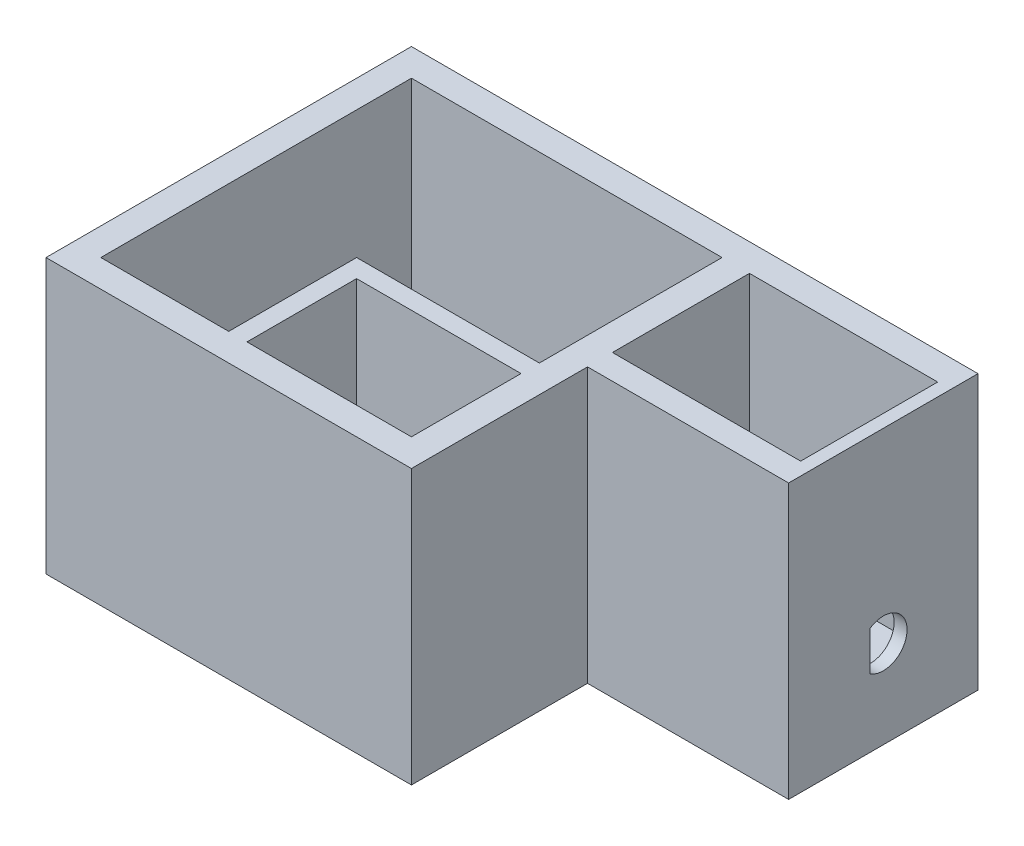
ISO-10303-21;
HEADER;
FILE_DESCRIPTION(('STEP AP214'),'2;1');
FILE_NAME('part.step','',(''),(''),'','','');
FILE_SCHEMA(('AUTOMOTIVE_DESIGN { 1 0 10303 214 1 1 1 1 }'));
ENDSEC;
DATA;
#1=APPLICATION_CONTEXT('core data for automotive mechanical design processes');
#2=APPLICATION_PROTOCOL_DEFINITION('international standard','automotive_design',2000,#1);
#3=PRODUCT_CONTEXT('',#1,'mechanical');
#4=PRODUCT('Part','Part','',(#3));
#5=PRODUCT_RELATED_PRODUCT_CATEGORY('part','',(#4));
#6=PRODUCT_DEFINITION_FORMATION('','',#4);
#7=PRODUCT_DEFINITION_CONTEXT('part definition',#1,'design');
#8=PRODUCT_DEFINITION('design','',#6,#7);
#9=PRODUCT_DEFINITION_SHAPE('','',#8);
#10=(LENGTH_UNIT() NAMED_UNIT(*) SI_UNIT(.MILLI.,.METRE.));
#11=(NAMED_UNIT(*) PLANE_ANGLE_UNIT() SI_UNIT($,.RADIAN.));
#12=(NAMED_UNIT(*) SI_UNIT($,.STERADIAN.) SOLID_ANGLE_UNIT());
#13=UNCERTAINTY_MEASURE_WITH_UNIT(LENGTH_MEASURE(1.E-05),#10,'distance_accuracy_value','');
#14=(GEOMETRIC_REPRESENTATION_CONTEXT(3) GLOBAL_UNCERTAINTY_ASSIGNED_CONTEXT((#13)) GLOBAL_UNIT_ASSIGNED_CONTEXT((#10,
#11,#12)) REPRESENTATION_CONTEXT('',''));
#15=CARTESIAN_POINT('',(0.,0.,0.));
#16=DIRECTION('',(0.,0.,1.));
#17=DIRECTION('',(1.,0.,0.));
#18=AXIS2_PLACEMENT_3D('',#15,#16,#17);
#19=CARTESIAN_POINT('',(0.,75.,0.));
#20=DIRECTION('',(0.,1.,0.));
#21=DIRECTION('',(0.,0.,1.));
#22=AXIS2_PLACEMENT_3D('',#19,#20,#21);
#23=PLANE('',#22);
#24=DIRECTION('',(0.,0.,-1.));
#25=VECTOR('',#24,1.);
#26=CARTESIAN_POINT('',(42.5,75.,-42.5));
#27=LINE('',#26,#25);
#28=CARTESIAN_POINT('',(42.5,75.,7.50000000000001));
#29=VERTEX_POINT('',#28);
#30=CARTESIAN_POINT('',(42.5,75.,-42.5));
#31=VERTEX_POINT('',#30);
#32=EDGE_CURVE('E279',#29,#31,#27,.T.);
#33=ORIENTED_EDGE('',*,*,#32,.F.);
#34=DIRECTION('',(-1.,0.,0.));
#35=VECTOR('',#34,1.);
#36=CARTESIAN_POINT('',(42.5,75.,7.50000000000001));
#37=LINE('',#36,#35);
#38=CARTESIAN_POINT('',(-7.49999999999999,75.,7.50000000000001));
#39=VERTEX_POINT('',#38);
#40=EDGE_CURVE('E481',#29,#39,#37,.T.);
#41=ORIENTED_EDGE('',*,*,#40,.T.);
#42=DIRECTION('',(0.,0.,1.));
#43=VECTOR('',#42,1.);
#44=CARTESIAN_POINT('',(-7.49999999999999,75.,42.5));
#45=LINE('',#44,#43);
#46=CARTESIAN_POINT('',(-7.49999999999999,75.,42.5));
#47=VERTEX_POINT('',#46);
#48=EDGE_CURVE('E483',#39,#47,#45,.T.);
#49=ORIENTED_EDGE('',*,*,#48,.T.);
#50=DIRECTION('',(1.,0.,0.));
#51=VECTOR('',#50,1.);
#52=CARTESIAN_POINT('',(-42.5,75.,42.5));
#53=LINE('',#52,#51);
#54=CARTESIAN_POINT('',(-42.5,75.,42.5));
#55=VERTEX_POINT('',#54);
#56=EDGE_CURVE('E288',#55,#47,#53,.T.);
#57=ORIENTED_EDGE('',*,*,#56,.F.);
#58=DIRECTION('',(0.,0.,1.));
#59=VECTOR('',#58,1.);
#60=CARTESIAN_POINT('',(-42.5,75.,-42.5));
#61=LINE('',#60,#59);
#62=CARTESIAN_POINT('',(-42.5,75.,-42.5));
#63=VERTEX_POINT('',#62);
#64=EDGE_CURVE('E285',#63,#55,#61,.T.);
#65=ORIENTED_EDGE('',*,*,#64,.F.);
#66=DIRECTION('',(-1.,0.,0.));
#67=VECTOR('',#66,1.);
#68=CARTESIAN_POINT('',(-42.5,75.,-42.5));
#69=LINE('',#68,#67);
#70=EDGE_CURVE('E281',#31,#63,#69,.T.);
#71=ORIENTED_EDGE('',*,*,#70,.F.);
#72=EDGE_LOOP('',(#33,#41,#49,#57,#65,#71));
#73=FACE_BOUND('',#72,.T.);
#74=DIRECTION('',(0.,0.,-1.));
#75=VECTOR('',#74,1.);
#76=CARTESIAN_POINT('',(50.,75.,-50.));
#77=LINE('',#76,#75);
#78=CARTESIAN_POINT('',(50.,75.,50.));
#79=VERTEX_POINT('',#78);
#80=CARTESIAN_POINT('',(50.,75.,1.82188212647816));
#81=VERTEX_POINT('',#80);
#82=EDGE_CURVE('E297',#79,#81,#77,.T.);
#83=ORIENTED_EDGE('',*,*,#82,.T.);
#84=DIRECTION('',(-1.,0.,0.));
#85=VECTOR('',#84,1.);
#86=CARTESIAN_POINT('',(50.,75.,1.82188212647816));
#87=LINE('',#86,#85);
#88=CARTESIAN_POINT('',(105.029985219062,75.,1.82188212647816));
#89=VERTEX_POINT('',#88);
#90=EDGE_CURVE('E396',#89,#81,#87,.T.);
#91=ORIENTED_EDGE('',*,*,#90,.F.);
#92=DIRECTION('',(0.,0.,1.));
#93=VECTOR('',#92,1.);
#94=CARTESIAN_POINT('',(105.029985219062,75.,-50.));
#95=LINE('',#94,#93);
#96=CARTESIAN_POINT('',(105.029985219062,75.,-50.));
#97=VERTEX_POINT('',#96);
#98=EDGE_CURVE('E393',#97,#89,#95,.T.);
#99=ORIENTED_EDGE('',*,*,#98,.F.);
#100=DIRECTION('',(-1.,0.,0.));
#101=VECTOR('',#100,1.);
#102=CARTESIAN_POINT('',(-50.,75.,-50.));
#103=LINE('',#102,#101);
#104=CARTESIAN_POINT('',(-50.,75.,-50.));
#105=VERTEX_POINT('',#104);
#106=EDGE_CURVE('E300',#97,#105,#103,.T.);
#107=ORIENTED_EDGE('',*,*,#106,.T.);
#108=DIRECTION('',(0.,0.,1.));
#109=VECTOR('',#108,1.);
#110=CARTESIAN_POINT('',(-50.,75.,-50.));
#111=LINE('',#110,#109);
#112=CARTESIAN_POINT('',(-50.,75.,50.));
#113=VERTEX_POINT('',#112);
#114=EDGE_CURVE('E303',#105,#113,#111,.T.);
#115=ORIENTED_EDGE('',*,*,#114,.T.);
#116=DIRECTION('',(1.,0.,0.));
#117=VECTOR('',#116,1.);
#118=CARTESIAN_POINT('',(-50.,75.,50.));
#119=LINE('',#118,#117);
#120=EDGE_CURVE('E305',#113,#79,#119,.T.);
#121=ORIENTED_EDGE('',*,*,#120,.T.);
#122=EDGE_LOOP('',(#83,#91,#99,#107,#115,#121));
#123=FACE_BOUND('',#122,.T.);
#124=DIRECTION('',(0.,0.,1.));
#125=VECTOR('',#124,1.);
#126=CARTESIAN_POINT('',(42.4897777080494,75.,0.));
#127=LINE('',#126,#125);
#128=CARTESIAN_POINT('',(42.4897777080494,75.,12.5));
#129=VERTEX_POINT('',#128);
#130=CARTESIAN_POINT('',(42.4897777080494,75.,42.5));
#131=VERTEX_POINT('',#130);
#132=EDGE_CURVE('E327',#129,#131,#127,.T.);
#133=ORIENTED_EDGE('',*,*,#132,.T.);
#134=DIRECTION('',(-1.,0.,0.));
#135=VECTOR('',#134,1.);
#136=CARTESIAN_POINT('',(0.,75.,42.5));
#137=LINE('',#136,#135);
#138=CARTESIAN_POINT('',(-2.51022229195064,75.,42.5));
#139=VERTEX_POINT('',#138);
#140=EDGE_CURVE('E330',#131,#139,#137,.T.);
#141=ORIENTED_EDGE('',*,*,#140,.T.);
#142=DIRECTION('',(0.,0.,1.));
#143=VECTOR('',#142,1.);
#144=CARTESIAN_POINT('',(-2.51022229195064,75.,0.));
#145=LINE('',#144,#143);
#146=CARTESIAN_POINT('',(-2.51022229195064,75.,12.5));
#147=VERTEX_POINT('',#146);
#148=EDGE_CURVE('E322',#147,#139,#145,.T.);
#149=ORIENTED_EDGE('',*,*,#148,.F.);
#150=DIRECTION('',(-1.,0.,0.));
#151=VECTOR('',#150,1.);
#152=CARTESIAN_POINT('',(0.,75.,12.5));
#153=LINE('',#152,#151);
#154=EDGE_CURVE('E324',#129,#147,#153,.T.);
#155=ORIENTED_EDGE('',*,*,#154,.F.);
#156=EDGE_LOOP('',(#133,#141,#149,#155));
#157=FACE_BOUND('',#156,.T.);
#158=DIRECTION('',(1.,0.,0.));
#159=VECTOR('',#158,1.);
#160=CARTESIAN_POINT('',(0.,75.,-42.5));
#161=LINE('',#160,#159);
#162=CARTESIAN_POINT('',(50.,75.,-42.5));
#163=VERTEX_POINT('',#162);
#164=CARTESIAN_POINT('',(101.5,75.,-42.5));
#165=VERTEX_POINT('',#164);
#166=EDGE_CURVE('E374',#163,#165,#161,.T.);
#167=ORIENTED_EDGE('',*,*,#166,.T.);
#168=DIRECTION('',(0.,0.,1.));
#169=VECTOR('',#168,1.);
#170=CARTESIAN_POINT('',(101.5,75.,0.));
#171=LINE('',#170,#169);
#172=CARTESIAN_POINT('',(101.5,75.,-5.));
#173=VERTEX_POINT('',#172);
#174=EDGE_CURVE('E337',#165,#173,#171,.T.);
#175=ORIENTED_EDGE('',*,*,#174,.T.);
#176=DIRECTION('',(1.,0.,0.));
#177=VECTOR('',#176,1.);
#178=CARTESIAN_POINT('',(0.,75.,-5.));
#179=LINE('',#178,#177);
#180=CARTESIAN_POINT('',(50.,75.,-5.));
#181=VERTEX_POINT('',#180);
#182=EDGE_CURVE('E363',#181,#173,#179,.T.);
#183=ORIENTED_EDGE('',*,*,#182,.F.);
#184=DIRECTION('',(0.,0.,1.));
#185=VECTOR('',#184,1.);
#186=CARTESIAN_POINT('',(50.,75.,0.));
#187=LINE('',#186,#185);
#188=EDGE_CURVE('E377',#163,#181,#187,.T.);
#189=ORIENTED_EDGE('',*,*,#188,.F.);
#190=EDGE_LOOP('',(#167,#175,#183,#189));
#191=FACE_BOUND('',#190,.T.);
#192=ADVANCED_FACE('F39',(#73,#123,#157,#191),#23,.T.);
#193=CARTESIAN_POINT('',(50.,75.,-50.));
#194=DIRECTION('',(-1.,0.,0.));
#195=DIRECTION('',(0.,0.,1.));
#196=AXIS2_PLACEMENT_3D('',#193,#194,#195);
#197=PLANE('',#196);
#198=DIRECTION('',(0.,-1.,0.));
#199=VECTOR('',#198,1.);
#200=CARTESIAN_POINT('',(50.,75.,1.82188212647816));
#201=LINE('',#200,#199);
#202=CARTESIAN_POINT('',(50.,0.,1.82188212647816));
#203=VERTEX_POINT('',#202);
#204=EDGE_CURVE('E406',#81,#203,#201,.T.);
#205=ORIENTED_EDGE('',*,*,#204,.F.);
#206=ORIENTED_EDGE('',*,*,#82,.F.);
#207=DIRECTION('',(0.,-1.,0.));
#208=VECTOR('',#207,1.);
#209=CARTESIAN_POINT('',(50.,75.,50.));
#210=LINE('',#209,#208);
#211=CARTESIAN_POINT('',(50.,0.,50.));
#212=VERTEX_POINT('',#211);
#213=EDGE_CURVE('E307',#79,#212,#210,.T.);
#214=ORIENTED_EDGE('',*,*,#213,.T.);
#215=DIRECTION('',(0.,0.,-1.));
#216=VECTOR('',#215,1.);
#217=CARTESIAN_POINT('',(50.,0.,-50.));
#218=LINE('',#217,#216);
#219=EDGE_CURVE('E293',#212,#203,#218,.T.);
#220=ORIENTED_EDGE('',*,*,#219,.T.);
#221=EDGE_LOOP('',(#205,#206,#214,#220));
#222=FACE_BOUND('',#221,.T.);
#223=ADVANCED_FACE('F41',(#222),#197,.F.);
#224=CARTESIAN_POINT('',(42.5,9.99999999999999,-42.5));
#225=DIRECTION('',(1.,0.,0.));
#226=DIRECTION('',(0.,0.,-1.));
#227=AXIS2_PLACEMENT_3D('',#224,#225,#226);
#228=PLANE('',#227);
#229=DIRECTION('',(0.,1.,0.));
#230=VECTOR('',#229,1.);
#231=CARTESIAN_POINT('',(42.5,9.99999999999999,0.));
#232=LINE('',#231,#230);
#233=CARTESIAN_POINT('',(42.5,10.,0.));
#234=VERTEX_POINT('',#233);
#235=CARTESIAN_POINT('',(42.5,17.7885607982944,0.));
#236=VERTEX_POINT('',#235);
#237=EDGE_CURVE('E441',#234,#236,#232,.T.);
#238=ORIENTED_EDGE('',*,*,#237,.F.);
#239=DIRECTION('',(0.,0.,-1.));
#240=VECTOR('',#239,1.);
#241=CARTESIAN_POINT('',(42.5,9.99999999999999,-42.5));
#242=LINE('',#241,#240);
#243=CARTESIAN_POINT('',(42.5,9.99999999999999,7.50000000000001));
#244=VERTEX_POINT('',#243);
#245=EDGE_CURVE('E269',#244,#234,#242,.T.);
#246=ORIENTED_EDGE('',*,*,#245,.F.);
#247=DIRECTION('',(0.,-1.,0.));
#248=VECTOR('',#247,1.);
#249=CARTESIAN_POINT('',(42.5,75.,7.50000000000001));
#250=LINE('',#249,#248);
#251=EDGE_CURVE('E282',#29,#244,#250,.T.);
#252=ORIENTED_EDGE('',*,*,#251,.F.);
#253=ORIENTED_EDGE('',*,*,#32,.T.);
#254=DIRECTION('',(0.,1.,0.));
#255=VECTOR('',#254,1.);
#256=CARTESIAN_POINT('',(42.5,9.99999999999999,-42.5));
#257=LINE('',#256,#255);
#258=CARTESIAN_POINT('',(42.5,9.99999999999999,-42.5));
#259=VERTEX_POINT('',#258);
#260=EDGE_CURVE('E278',#259,#31,#257,.T.);
#261=ORIENTED_EDGE('',*,*,#260,.F.);
#262=CARTESIAN_POINT('',(42.5,10.,-28.617843408747));
#263=VERTEX_POINT('',#262);
#264=EDGE_CURVE('E266',#263,#259,#242,.T.);
#265=ORIENTED_EDGE('',*,*,#264,.F.);
#266=DIRECTION('',(0.,1.,0.));
#267=VECTOR('',#266,1.);
#268=CARTESIAN_POINT('',(42.5,9.99999999999999,-28.617843408747));
#269=LINE('',#268,#267);
#270=CARTESIAN_POINT('',(42.5,17.7885607982944,-28.617843408747));
#271=VERTEX_POINT('',#270);
#272=EDGE_CURVE('E428',#263,#271,#269,.T.);
#273=ORIENTED_EDGE('',*,*,#272,.T.);
#274=DIRECTION('',(0.,0.,-1.));
#275=VECTOR('',#274,1.);
#276=CARTESIAN_POINT('',(42.5,17.7885607982944,-42.5));
#277=LINE('',#276,#275);
#278=EDGE_CURVE('E438',#236,#271,#277,.T.);
#279=ORIENTED_EDGE('',*,*,#278,.F.);
#280=EDGE_LOOP('',(#238,#246,#252,#253,#261,#265,#273,#279));
#281=FACE_BOUND('',#280,.T.);
#282=ADVANCED_FACE('F505',(#281),#228,.F.);
#283=CARTESIAN_POINT('',(-42.5,9.99999999999999,42.5));
#284=DIRECTION('',(0.,0.,1.));
#285=DIRECTION('',(1.,0.,0.));
#286=AXIS2_PLACEMENT_3D('',#283,#284,#285);
#287=PLANE('',#286);
#288=DIRECTION('',(0.,-1.,0.));
#289=VECTOR('',#288,1.);
#290=CARTESIAN_POINT('',(-7.49999999999999,75.,42.5));
#291=LINE('',#290,#289);
#292=CARTESIAN_POINT('',(-7.49999999999999,20.8469699351781,42.5));
#293=VERTEX_POINT('',#292);
#294=EDGE_CURVE('E486',#47,#293,#291,.T.);
#295=ORIENTED_EDGE('',*,*,#294,.T.);
#296=DIRECTION('',(1.,0.,0.));
#297=VECTOR('',#296,1.);
#298=CARTESIAN_POINT('',(-18.5102222919506,20.8469699351781,42.5));
#299=LINE('',#298,#297);
#300=CARTESIAN_POINT('',(-2.51022229195064,20.8469699351781,42.5));
#301=VERTEX_POINT('',#300);
#302=EDGE_CURVE('E453',#293,#301,#299,.T.);
#303=ORIENTED_EDGE('',*,*,#302,.T.);
#304=DIRECTION('',(0.,-1.,0.));
#305=VECTOR('',#304,1.);
#306=CARTESIAN_POINT('',(-2.51022229195064,75.000012,42.5));
#307=LINE('',#306,#305);
#308=EDGE_CURVE('E469',#139,#301,#307,.T.);
#309=ORIENTED_EDGE('',*,*,#308,.F.);
#310=ORIENTED_EDGE('',*,*,#140,.F.);
#311=DIRECTION('',(0.,-1.,0.));
#312=VECTOR('',#311,1.);
#313=CARTESIAN_POINT('',(42.4897777080494,75.000012,42.5));
#314=LINE('',#313,#312);
#315=CARTESIAN_POINT('',(42.4897777080494,9.99999999999999,42.5));
#316=VERTEX_POINT('',#315);
#317=EDGE_CURVE('E477',#131,#316,#314,.T.);
#318=ORIENTED_EDGE('',*,*,#317,.T.);
#319=DIRECTION('',(1.,0.,0.));
#320=VECTOR('',#319,1.);
#321=CARTESIAN_POINT('',(-42.5,9.99999999999999,42.5));
#322=LINE('',#321,#320);
#323=CARTESIAN_POINT('',(-42.5,9.99999999999999,42.5));
#324=VERTEX_POINT('',#323);
#325=EDGE_CURVE('E272',#324,#316,#322,.T.);
#326=ORIENTED_EDGE('',*,*,#325,.F.);
#327=DIRECTION('',(0.,1.,0.));
#328=VECTOR('',#327,1.);
#329=CARTESIAN_POINT('',(-42.5,9.99999999999999,42.5));
#330=LINE('',#329,#328);
#331=EDGE_CURVE('E291',#324,#55,#330,.T.);
#332=ORIENTED_EDGE('',*,*,#331,.T.);
#333=ORIENTED_EDGE('',*,*,#56,.T.);
#334=EDGE_LOOP('',(#295,#303,#309,#310,#318,#326,#332,#333));
#335=FACE_BOUND('',#334,.T.);
#336=ADVANCED_FACE('F562',(#335),#287,.F.);
#337=CARTESIAN_POINT('',(0.,9.99999999999999,0.));
#338=DIRECTION('',(0.,1.,0.));
#339=DIRECTION('',(0.,0.,1.));
#340=AXIS2_PLACEMENT_3D('',#337,#338,#339);
#341=PLANE('',#340);
#342=ORIENTED_EDGE('',*,*,#245,.T.);
#343=DIRECTION('',(1.,0.,0.));
#344=VECTOR('',#343,1.);
#345=CARTESIAN_POINT('',(39.,10.,0.));
#346=LINE('',#345,#344);
#347=CARTESIAN_POINT('',(50.,10.,0.));
#348=VERTEX_POINT('',#347);
#349=EDGE_CURVE('E426',#234,#348,#346,.T.);
#350=ORIENTED_EDGE('',*,*,#349,.T.);
#351=DIRECTION('',(0.,0.,-1.));
#352=VECTOR('',#351,1.);
#353=CARTESIAN_POINT('',(50.,10.,0.));
#354=LINE('',#353,#352);
#355=CARTESIAN_POINT('',(50.,10.,-5.));
#356=VERTEX_POINT('',#355);
#357=EDGE_CURVE('E409',#348,#356,#354,.T.);
#358=ORIENTED_EDGE('',*,*,#357,.T.);
#359=DIRECTION('',(1.,0.,0.));
#360=VECTOR('',#359,1.);
#361=CARTESIAN_POINT('',(0.,9.99999999999999,-5.));
#362=LINE('',#361,#360);
#363=CARTESIAN_POINT('',(101.5,9.99999999999999,-5.));
#364=VERTEX_POINT('',#363);
#365=EDGE_CURVE('E368',#356,#364,#362,.T.);
#366=ORIENTED_EDGE('',*,*,#365,.T.);
#367=DIRECTION('',(0.,0.,1.));
#368=VECTOR('',#367,1.);
#369=CARTESIAN_POINT('',(101.5,9.99999999999999,0.));
#370=LINE('',#369,#368);
#371=CARTESIAN_POINT('',(101.5,9.99999999999999,-42.5));
#372=VERTEX_POINT('',#371);
#373=EDGE_CURVE('E360',#372,#364,#370,.T.);
#374=ORIENTED_EDGE('',*,*,#373,.F.);
#375=DIRECTION('',(1.,0.,0.));
#376=VECTOR('',#375,1.);
#377=CARTESIAN_POINT('',(0.,9.99999999999999,-42.5));
#378=LINE('',#377,#376);
#379=CARTESIAN_POINT('',(50.,9.99999999999999,-42.5));
#380=VERTEX_POINT('',#379);
#381=EDGE_CURVE('E362',#380,#372,#378,.T.);
#382=ORIENTED_EDGE('',*,*,#381,.F.);
#383=DIRECTION('',(0.,0.,1.));
#384=VECTOR('',#383,1.);
#385=CARTESIAN_POINT('',(50.,9.99999999999999,0.));
#386=LINE('',#385,#384);
#387=CARTESIAN_POINT('',(50.,9.99999999999999,-28.617843408747));
#388=VERTEX_POINT('',#387);
#389=EDGE_CURVE('E365',#380,#388,#386,.T.);
#390=ORIENTED_EDGE('',*,*,#389,.T.);
#391=DIRECTION('',(1.,0.,0.));
#392=VECTOR('',#391,1.);
#393=CARTESIAN_POINT('',(39.,10.,-28.617843408747));
#394=LINE('',#393,#392);
#395=EDGE_CURVE('E425',#263,#388,#394,.T.);
#396=ORIENTED_EDGE('',*,*,#395,.F.);
#397=ORIENTED_EDGE('',*,*,#264,.T.);
#398=DIRECTION('',(-1.,0.,0.));
#399=VECTOR('',#398,1.);
#400=CARTESIAN_POINT('',(-42.5,9.99999999999999,-42.5));
#401=LINE('',#400,#399);
#402=CARTESIAN_POINT('',(-27.5,9.99999999999999,-42.5));
#403=VERTEX_POINT('',#402);
#404=EDGE_CURVE('E259',#259,#403,#401,.T.);
#405=ORIENTED_EDGE('',*,*,#404,.T.);
#406=DIRECTION('',(0.,0.,1.));
#407=VECTOR('',#406,1.);
#408=CARTESIAN_POINT('',(-27.5,9.99999999999999,-52.5));
#409=LINE('',#408,#407);
#410=CARTESIAN_POINT('',(-27.5,9.99999999999999,-50.));
#411=VERTEX_POINT('',#410);
#412=EDGE_CURVE('E54',#411,#403,#409,.T.);
#413=ORIENTED_EDGE('',*,*,#412,.F.);
#414=DIRECTION('',(1.,0.,0.));
#415=VECTOR('',#414,1.);
#416=CARTESIAN_POINT('',(-50.,9.99999999999999,-50.));
#417=LINE('',#416,#415);
#418=CARTESIAN_POINT('',(-42.5,9.99999999999999,-50.));
#419=VERTEX_POINT('',#418);
#420=EDGE_CURVE('E549',#419,#411,#417,.T.);
#421=ORIENTED_EDGE('',*,*,#420,.F.);
#422=DIRECTION('',(0.,0.,1.));
#423=VECTOR('',#422,1.);
#424=CARTESIAN_POINT('',(-42.5,9.99999999999999,-42.5));
#425=LINE('',#424,#423);
#426=EDGE_CURVE('E268',#419,#324,#425,.T.);
#427=ORIENTED_EDGE('',*,*,#426,.T.);
#428=ORIENTED_EDGE('',*,*,#325,.T.);
#429=DIRECTION('',(0.,0.,-1.));
#430=VECTOR('',#429,1.);
#431=CARTESIAN_POINT('',(42.4897777080494,9.99999999999999,0.));
#432=LINE('',#431,#430);
#433=CARTESIAN_POINT('',(42.4897777080494,9.99999999999999,12.5));
#434=VERTEX_POINT('',#433);
#435=EDGE_CURVE('E461',#316,#434,#432,.T.);
#436=ORIENTED_EDGE('',*,*,#435,.T.);
#437=DIRECTION('',(1.,0.,0.));
#438=VECTOR('',#437,1.);
#439=CARTESIAN_POINT('',(0.,9.99999999999999,12.5));
#440=LINE('',#439,#438);
#441=CARTESIAN_POINT('',(-2.51022229195064,9.99999999999999,12.5));
#442=VERTEX_POINT('',#441);
#443=EDGE_CURVE('E464',#442,#434,#440,.T.);
#444=ORIENTED_EDGE('',*,*,#443,.F.);
#445=DIRECTION('',(0.,0.,-1.));
#446=VECTOR('',#445,1.);
#447=CARTESIAN_POINT('',(-2.51022229195064,9.99999999999999,0.));
#448=LINE('',#447,#446);
#449=CARTESIAN_POINT('',(-2.51022229195064,9.99999999999999,27.5));
#450=VERTEX_POINT('',#449);
#451=EDGE_CURVE('E467',#450,#442,#448,.T.);
#452=ORIENTED_EDGE('',*,*,#451,.F.);
#453=DIRECTION('',(1.,0.,0.));
#454=VECTOR('',#453,1.);
#455=CARTESIAN_POINT('',(-18.5102222919506,9.99999999999999,27.5));
#456=LINE('',#455,#454);
#457=CARTESIAN_POINT('',(-7.49999999999999,9.99999999999999,27.5));
#458=VERTEX_POINT('',#457);
#459=EDGE_CURVE('E450',#458,#450,#456,.T.);
#460=ORIENTED_EDGE('',*,*,#459,.F.);
#461=DIRECTION('',(0.,0.,1.));
#462=VECTOR('',#461,1.);
#463=CARTESIAN_POINT('',(-7.49999999999999,9.99999999999999,42.5));
#464=LINE('',#463,#462);
#465=CARTESIAN_POINT('',(-7.49999999999999,9.99999999999999,7.50000000000001));
#466=VERTEX_POINT('',#465);
#467=EDGE_CURVE('E484',#466,#458,#464,.T.);
#468=ORIENTED_EDGE('',*,*,#467,.F.);
#469=DIRECTION('',(-1.,0.,0.));
#470=VECTOR('',#469,1.);
#471=CARTESIAN_POINT('',(42.5,9.99999999999999,7.50000000000001));
#472=LINE('',#471,#470);
#473=EDGE_CURVE('E480',#244,#466,#472,.T.);
#474=ORIENTED_EDGE('',*,*,#473,.F.);
#475=EDGE_LOOP('',(#342,#350,#358,#366,#374,#382,#390,#396,#397,#405,#413,#421,#427,#428,#436,
#444,#452,#460,#468,#474));
#476=FACE_BOUND('',#475,.T.);
#477=ADVANCED_FACE('F263',(#476),#341,.T.);
#478=CARTESIAN_POINT('',(-50.,75.,-50.));
#479=DIRECTION('',(0.,0.,1.));
#480=DIRECTION('',(1.,0.,0.));
#481=AXIS2_PLACEMENT_3D('',#478,#479,#480);
#482=PLANE('',#481);
#483=DIRECTION('',(-1.,0.,0.));
#484=VECTOR('',#483,1.);
#485=CARTESIAN_POINT('',(-50.,25.,-50.));
#486=LINE('',#485,#484);
#487=CARTESIAN_POINT('',(-27.5,25.,-50.));
#488=VERTEX_POINT('',#487);
#489=CARTESIAN_POINT('',(-42.5,25.,-50.));
#490=VERTEX_POINT('',#489);
#491=EDGE_CURVE('E356',#488,#490,#486,.T.);
#492=ORIENTED_EDGE('',*,*,#491,.T.);
#493=DIRECTION('',(0.,-1.,0.));
#494=VECTOR('',#493,1.);
#495=CARTESIAN_POINT('',(-42.5,75.,-50.));
#496=LINE('',#495,#494);
#497=EDGE_CURVE('E352',#490,#419,#496,.T.);
#498=ORIENTED_EDGE('',*,*,#497,.T.);
#499=ORIENTED_EDGE('',*,*,#420,.T.);
#500=DIRECTION('',(0.,1.,0.));
#501=VECTOR('',#500,1.);
#502=CARTESIAN_POINT('',(-27.5,75.,-50.));
#503=LINE('',#502,#501);
#504=EDGE_CURVE('E249',#411,#488,#503,.T.);
#505=ORIENTED_EDGE('',*,*,#504,.T.);
#506=EDGE_LOOP('',(#492,#498,#499,#505));
#507=FACE_BOUND('',#506,.T.);
#508=DIRECTION('',(-1.,0.,0.));
#509=VECTOR('',#508,1.);
#510=CARTESIAN_POINT('',(-50.,0.,-50.));
#511=LINE('',#510,#509);
#512=CARTESIAN_POINT('',(105.029985219062,0.,-50.));
#513=VERTEX_POINT('',#512);
#514=CARTESIAN_POINT('',(-50.,0.,-50.));
#515=VERTEX_POINT('',#514);
#516=EDGE_CURVE('E309',#513,#515,#511,.T.);
#517=ORIENTED_EDGE('',*,*,#516,.T.);
#518=DIRECTION('',(0.,-1.,0.));
#519=VECTOR('',#518,1.);
#520=CARTESIAN_POINT('',(-50.,75.,-50.));
#521=LINE('',#520,#519);
#522=EDGE_CURVE('E319',#105,#515,#521,.T.);
#523=ORIENTED_EDGE('',*,*,#522,.F.);
#524=ORIENTED_EDGE('',*,*,#106,.F.);
#525=DIRECTION('',(0.,-1.,0.));
#526=VECTOR('',#525,1.);
#527=CARTESIAN_POINT('',(105.029985219062,75.,-50.));
#528=LINE('',#527,#526);
#529=EDGE_CURVE('E400',#97,#513,#528,.T.);
#530=ORIENTED_EDGE('',*,*,#529,.T.);
#531=EDGE_LOOP('',(#517,#523,#524,#530));
#532=FACE_BOUND('',#531,.T.);
#533=ADVANCED_FACE('F558',(#507,#532),#482,.F.);
#534=CARTESIAN_POINT('',(-50.,75.,-50.));
#535=DIRECTION('',(1.,0.,0.));
#536=DIRECTION('',(0.,0.,-1.));
#537=AXIS2_PLACEMENT_3D('',#534,#535,#536);
#538=PLANE('',#537);
#539=DIRECTION('',(0.,0.,1.));
#540=VECTOR('',#539,1.);
#541=CARTESIAN_POINT('',(-50.,0.,-50.));
#542=LINE('',#541,#540);
#543=CARTESIAN_POINT('',(-50.,0.,50.));
#544=VERTEX_POINT('',#543);
#545=EDGE_CURVE('E311',#515,#544,#542,.T.);
#546=ORIENTED_EDGE('',*,*,#545,.T.);
#547=DIRECTION('',(0.,-1.,0.));
#548=VECTOR('',#547,1.);
#549=CARTESIAN_POINT('',(-50.,75.,50.));
#550=LINE('',#549,#548);
#551=EDGE_CURVE('E316',#113,#544,#550,.T.);
#552=ORIENTED_EDGE('',*,*,#551,.F.);
#553=ORIENTED_EDGE('',*,*,#114,.F.);
#554=ORIENTED_EDGE('',*,*,#522,.T.);
#555=EDGE_LOOP('',(#546,#552,#553,#554));
#556=FACE_BOUND('',#555,.T.);
#557=ADVANCED_FACE('F613',(#556),#538,.F.);
#558=CARTESIAN_POINT('',(-50.,75.,50.));
#559=DIRECTION('',(0.,0.,-1.));
#560=DIRECTION('',(-1.,0.,0.));
#561=AXIS2_PLACEMENT_3D('',#558,#559,#560);
#562=PLANE('',#561);
#563=DIRECTION('',(1.,0.,0.));
#564=VECTOR('',#563,1.);
#565=CARTESIAN_POINT('',(-50.,0.,50.));
#566=LINE('',#565,#564);
#567=EDGE_CURVE('E301',#544,#212,#566,.T.);
#568=ORIENTED_EDGE('',*,*,#567,.T.);
#569=ORIENTED_EDGE('',*,*,#213,.F.);
#570=ORIENTED_EDGE('',*,*,#120,.F.);
#571=ORIENTED_EDGE('',*,*,#551,.T.);
#572=EDGE_LOOP('',(#568,#569,#570,#571));
#573=FACE_BOUND('',#572,.T.);
#574=ADVANCED_FACE('F609',(#573),#562,.F.);
#575=CARTESIAN_POINT('',(0.,0.,0.));
#576=DIRECTION('',(0.,1.,0.));
#577=DIRECTION('',(0.,0.,1.));
#578=AXIS2_PLACEMENT_3D('',#575,#576,#577);
#579=PLANE('',#578);
#580=ORIENTED_EDGE('',*,*,#219,.F.);
#581=ORIENTED_EDGE('',*,*,#567,.F.);
#582=ORIENTED_EDGE('',*,*,#545,.F.);
#583=ORIENTED_EDGE('',*,*,#516,.F.);
#584=DIRECTION('',(0.,0.,1.));
#585=VECTOR('',#584,1.);
#586=CARTESIAN_POINT('',(105.029985219062,0.,-50.));
#587=LINE('',#586,#585);
#588=CARTESIAN_POINT('',(105.029985219062,0.,1.82188212647816));
#589=VERTEX_POINT('',#588);
#590=EDGE_CURVE('E401',#513,#589,#587,.T.);
#591=ORIENTED_EDGE('',*,*,#590,.T.);
#592=DIRECTION('',(-1.,0.,0.));
#593=VECTOR('',#592,1.);
#594=CARTESIAN_POINT('',(50.,0.,1.82188212647816));
#595=LINE('',#594,#593);
#596=EDGE_CURVE('E397',#589,#203,#595,.T.);
#597=ORIENTED_EDGE('',*,*,#596,.T.);
#598=EDGE_LOOP('',(#580,#581,#582,#583,#591,#597));
#599=FACE_BOUND('',#598,.T.);
#600=ADVANCED_FACE('F606',(#599),#579,.F.);
#601=CARTESIAN_POINT('',(-42.5,9.99999999999999,-42.5));
#602=DIRECTION('',(-1.,0.,0.));
#603=DIRECTION('',(0.,0.,1.));
#604=AXIS2_PLACEMENT_3D('',#601,#602,#603);
#605=PLANE('',#604);
#606=ORIENTED_EDGE('',*,*,#64,.T.);
#607=ORIENTED_EDGE('',*,*,#331,.F.);
#608=ORIENTED_EDGE('',*,*,#426,.F.);
#609=ORIENTED_EDGE('',*,*,#497,.F.);
#610=DIRECTION('',(0.,0.,1.));
#611=VECTOR('',#610,1.);
#612=CARTESIAN_POINT('',(-42.5,25.,-52.5));
#613=LINE('',#612,#611);
#614=CARTESIAN_POINT('',(-42.5,25.,-42.5));
#615=VERTEX_POINT('',#614);
#616=EDGE_CURVE('E546',#490,#615,#613,.T.);
#617=ORIENTED_EDGE('',*,*,#616,.T.);
#618=DIRECTION('',(0.,1.,0.));
#619=VECTOR('',#618,1.);
#620=CARTESIAN_POINT('',(-42.5,9.99999999999999,-42.5));
#621=LINE('',#620,#619);
#622=EDGE_CURVE('E294',#615,#63,#621,.T.);
#623=ORIENTED_EDGE('',*,*,#622,.T.);
#624=EDGE_LOOP('',(#606,#607,#608,#609,#617,#623));
#625=FACE_BOUND('',#624,.T.);
#626=ADVANCED_FACE('F544',(#625),#605,.F.);
#627=CARTESIAN_POINT('',(-42.5,9.99999999999999,-42.5));
#628=DIRECTION('',(0.,0.,-1.));
#629=DIRECTION('',(-1.,0.,0.));
#630=AXIS2_PLACEMENT_3D('',#627,#628,#629);
#631=PLANE('',#630);
#632=ORIENTED_EDGE('',*,*,#622,.F.);
#633=DIRECTION('',(-1.,0.,0.));
#634=VECTOR('',#633,1.);
#635=CARTESIAN_POINT('',(-42.5,25.,-42.5));
#636=LINE('',#635,#634);
#637=CARTESIAN_POINT('',(-27.5,25.,-42.5));
#638=VERTEX_POINT('',#637);
#639=EDGE_CURVE('E252',#638,#615,#636,.T.);
#640=ORIENTED_EDGE('',*,*,#639,.F.);
#641=DIRECTION('',(0.,1.,0.));
#642=VECTOR('',#641,1.);
#643=CARTESIAN_POINT('',(-27.5,9.99999999999999,-42.5));
#644=LINE('',#643,#642);
#645=EDGE_CURVE('E246',#403,#638,#644,.T.);
#646=ORIENTED_EDGE('',*,*,#645,.F.);
#647=ORIENTED_EDGE('',*,*,#404,.F.);
#648=ORIENTED_EDGE('',*,*,#260,.T.);
#649=ORIENTED_EDGE('',*,*,#70,.T.);
#650=EDGE_LOOP('',(#632,#640,#646,#647,#648,#649));
#651=FACE_BOUND('',#650,.T.);
#652=ADVANCED_FACE('F257',(#651),#631,.F.);
#653=CARTESIAN_POINT('',(42.5,75.,7.50000000000001));
#654=DIRECTION('',(0.,0.,1.));
#655=DIRECTION('',(1.,0.,0.));
#656=AXIS2_PLACEMENT_3D('',#653,#654,#655);
#657=PLANE('',#656);
#658=ORIENTED_EDGE('',*,*,#473,.T.);
#659=DIRECTION('',(0.,-1.,0.));
#660=VECTOR('',#659,1.);
#661=CARTESIAN_POINT('',(-7.49999999999999,75.,7.50000000000001));
#662=LINE('',#661,#660);
#663=EDGE_CURVE('E493',#39,#466,#662,.T.);
#664=ORIENTED_EDGE('',*,*,#663,.F.);
#665=ORIENTED_EDGE('',*,*,#40,.F.);
#666=ORIENTED_EDGE('',*,*,#251,.T.);
#667=EDGE_LOOP('',(#658,#664,#665,#666));
#668=FACE_BOUND('',#667,.T.);
#669=ADVANCED_FACE('F497',(#668),#657,.F.);
#670=CARTESIAN_POINT('',(-7.49999999999999,75.,42.5));
#671=DIRECTION('',(1.,0.,0.));
#672=DIRECTION('',(0.,0.,-1.));
#673=AXIS2_PLACEMENT_3D('',#670,#671,#672);
#674=PLANE('',#673);
#675=ORIENTED_EDGE('',*,*,#467,.T.);
#676=DIRECTION('',(0.,1.,0.));
#677=VECTOR('',#676,1.);
#678=CARTESIAN_POINT('',(-7.49999999999999,75.,27.5));
#679=LINE('',#678,#677);
#680=CARTESIAN_POINT('',(-7.49999999999999,20.8469699351781,27.5));
#681=VERTEX_POINT('',#680);
#682=EDGE_CURVE('E458',#458,#681,#679,.T.);
#683=ORIENTED_EDGE('',*,*,#682,.T.);
#684=DIRECTION('',(0.,0.,1.));
#685=VECTOR('',#684,1.);
#686=CARTESIAN_POINT('',(-7.49999999999999,20.8469699351781,42.5));
#687=LINE('',#686,#685);
#688=EDGE_CURVE('E452',#681,#293,#687,.T.);
#689=ORIENTED_EDGE('',*,*,#688,.T.);
#690=ORIENTED_EDGE('',*,*,#294,.F.);
#691=ORIENTED_EDGE('',*,*,#48,.F.);
#692=ORIENTED_EDGE('',*,*,#663,.T.);
#693=EDGE_LOOP('',(#675,#683,#689,#690,#691,#692));
#694=FACE_BOUND('',#693,.T.);
#695=ADVANCED_FACE('F583',(#694),#674,.F.);
#696=CARTESIAN_POINT('',(42.4897777080494,75.000012,0.));
#697=DIRECTION('',(-1.,0.,0.));
#698=DIRECTION('',(0.,0.,1.));
#699=AXIS2_PLACEMENT_3D('',#696,#697,#698);
#700=PLANE('',#699);
#701=DIRECTION('',(0.,-1.,0.));
#702=VECTOR('',#701,1.);
#703=CARTESIAN_POINT('',(42.4897777080494,75.000012,12.5));
#704=LINE('',#703,#702);
#705=EDGE_CURVE('E475',#129,#434,#704,.T.);
#706=ORIENTED_EDGE('',*,*,#705,.T.);
#707=ORIENTED_EDGE('',*,*,#435,.F.);
#708=ORIENTED_EDGE('',*,*,#317,.F.);
#709=ORIENTED_EDGE('',*,*,#132,.F.);
#710=EDGE_LOOP('',(#706,#707,#708,#709));
#711=FACE_BOUND('',#710,.T.);
#712=ADVANCED_FACE('F567',(#711),#700,.T.);
#713=CARTESIAN_POINT('',(0.,75.000012,12.5));
#714=DIRECTION('',(0.,0.,-1.));
#715=DIRECTION('',(-1.,0.,0.));
#716=AXIS2_PLACEMENT_3D('',#713,#714,#715);
#717=PLANE('',#716);
#718=ORIENTED_EDGE('',*,*,#154,.T.);
#719=DIRECTION('',(0.,-1.,0.));
#720=VECTOR('',#719,1.);
#721=CARTESIAN_POINT('',(-2.51022229195064,75.000012,12.5));
#722=LINE('',#721,#720);
#723=EDGE_CURVE('E472',#147,#442,#722,.T.);
#724=ORIENTED_EDGE('',*,*,#723,.T.);
#725=ORIENTED_EDGE('',*,*,#443,.T.);
#726=ORIENTED_EDGE('',*,*,#705,.F.);
#727=EDGE_LOOP('',(#718,#724,#725,#726));
#728=FACE_BOUND('',#727,.T.);
#729=ADVANCED_FACE('F572',(#728),#717,.F.);
#730=CARTESIAN_POINT('',(-2.51022229195064,75.000012,0.));
#731=DIRECTION('',(-1.,0.,0.));
#732=DIRECTION('',(0.,0.,1.));
#733=AXIS2_PLACEMENT_3D('',#730,#731,#732);
#734=PLANE('',#733);
#735=DIRECTION('',(0.,0.,1.));
#736=VECTOR('',#735,1.);
#737=CARTESIAN_POINT('',(-2.51022229195064,20.8469699351781,27.5));
#738=LINE('',#737,#736);
#739=CARTESIAN_POINT('',(-2.51022229195064,20.8469699351781,27.5));
#740=VERTEX_POINT('',#739);
#741=EDGE_CURVE('E446',#740,#301,#738,.T.);
#742=ORIENTED_EDGE('',*,*,#741,.F.);
#743=DIRECTION('',(0.,1.,0.));
#744=VECTOR('',#743,1.);
#745=CARTESIAN_POINT('',(-2.51022229195064,9.99999999999999,27.5));
#746=LINE('',#745,#744);
#747=EDGE_CURVE('E443',#450,#740,#746,.T.);
#748=ORIENTED_EDGE('',*,*,#747,.F.);
#749=ORIENTED_EDGE('',*,*,#451,.T.);
#750=ORIENTED_EDGE('',*,*,#723,.F.);
#751=ORIENTED_EDGE('',*,*,#148,.T.);
#752=ORIENTED_EDGE('',*,*,#308,.T.);
#753=EDGE_LOOP('',(#742,#748,#749,#750,#751,#752));
#754=FACE_BOUND('',#753,.T.);
#755=ADVANCED_FACE('F577',(#754),#734,.F.);
#756=CARTESIAN_POINT('',(-18.5102222919506,9.99999999999999,27.5));
#757=DIRECTION('',(0.,0.,-1.));
#758=DIRECTION('',(-1.,0.,0.));
#759=AXIS2_PLACEMENT_3D('',#756,#757,#758);
#760=PLANE('',#759);
#761=ORIENTED_EDGE('',*,*,#459,.T.);
#762=ORIENTED_EDGE('',*,*,#747,.T.);
#763=DIRECTION('',(1.,0.,0.));
#764=VECTOR('',#763,1.);
#765=CARTESIAN_POINT('',(-18.5102222919506,20.8469699351781,27.5));
#766=LINE('',#765,#764);
#767=EDGE_CURVE('E449',#681,#740,#766,.T.);
#768=ORIENTED_EDGE('',*,*,#767,.F.);
#769=ORIENTED_EDGE('',*,*,#682,.F.);
#770=EDGE_LOOP('',(#761,#762,#768,#769));
#771=FACE_BOUND('',#770,.T.);
#772=ADVANCED_FACE('F581',(#771),#760,.F.);
#773=CARTESIAN_POINT('',(-18.5102222919506,20.8469699351781,27.5));
#774=DIRECTION('',(0.,1.,0.));
#775=DIRECTION('',(0.,0.,1.));
#776=AXIS2_PLACEMENT_3D('',#773,#774,#775);
#777=PLANE('',#776);
#778=ORIENTED_EDGE('',*,*,#767,.T.);
#779=ORIENTED_EDGE('',*,*,#741,.T.);
#780=ORIENTED_EDGE('',*,*,#302,.F.);
#781=ORIENTED_EDGE('',*,*,#688,.F.);
#782=EDGE_LOOP('',(#778,#779,#780,#781));
#783=FACE_BOUND('',#782,.T.);
#784=ADVANCED_FACE('F587',(#783),#777,.F.);
#785=CARTESIAN_POINT('',(39.,0.,0.));
#786=DIRECTION('',(0.,0.,-1.));
#787=DIRECTION('',(-1.,0.,0.));
#788=AXIS2_PLACEMENT_3D('',#785,#786,#787);
#789=PLANE('',#788);
#790=ORIENTED_EDGE('',*,*,#237,.T.);
#791=DIRECTION('',(1.,0.,0.));
#792=VECTOR('',#791,1.);
#793=CARTESIAN_POINT('',(39.,17.7885607982944,0.));
#794=LINE('',#793,#792);
#795=CARTESIAN_POINT('',(50.,17.7885607982944,0.));
#796=VERTEX_POINT('',#795);
#797=EDGE_CURVE('E429',#236,#796,#794,.T.);
#798=ORIENTED_EDGE('',*,*,#797,.T.);
#799=DIRECTION('',(0.,1.,0.));
#800=VECTOR('',#799,1.);
#801=CARTESIAN_POINT('',(50.,0.,0.));
#802=LINE('',#801,#800);
#803=EDGE_CURVE('E422',#348,#796,#802,.T.);
#804=ORIENTED_EDGE('',*,*,#803,.F.);
#805=ORIENTED_EDGE('',*,*,#349,.F.);
#806=EDGE_LOOP('',(#790,#798,#804,#805));
#807=FACE_BOUND('',#806,.T.);
#808=ADVANCED_FACE('F509',(#807),#789,.T.);
#809=CARTESIAN_POINT('',(39.,17.7885607982944,0.));
#810=DIRECTION('',(0.,-1.,0.));
#811=DIRECTION('',(0.,0.,-1.));
#812=AXIS2_PLACEMENT_3D('',#809,#810,#811);
#813=PLANE('',#812);
#814=ORIENTED_EDGE('',*,*,#278,.T.);
#815=DIRECTION('',(1.,0.,0.));
#816=VECTOR('',#815,1.);
#817=CARTESIAN_POINT('',(39.,17.7885607982944,-28.617843408747));
#818=LINE('',#817,#816);
#819=CARTESIAN_POINT('',(50.,17.7885607982944,-28.617843408747));
#820=VERTEX_POINT('',#819);
#821=EDGE_CURVE('E431',#271,#820,#818,.T.);
#822=ORIENTED_EDGE('',*,*,#821,.T.);
#823=DIRECTION('',(0.,0.,-1.));
#824=VECTOR('',#823,1.);
#825=CARTESIAN_POINT('',(50.,17.7885607982944,0.));
#826=LINE('',#825,#824);
#827=CARTESIAN_POINT('',(50.,17.7885607982944,-5.));
#828=VERTEX_POINT('',#827);
#829=EDGE_CURVE('E384',#828,#820,#826,.T.);
#830=ORIENTED_EDGE('',*,*,#829,.F.);
#831=EDGE_CURVE('E419',#796,#828,#826,.T.);
#832=ORIENTED_EDGE('',*,*,#831,.F.);
#833=ORIENTED_EDGE('',*,*,#797,.F.);
#834=EDGE_LOOP('',(#814,#822,#830,#832,#833));
#835=FACE_BOUND('',#834,.T.);
#836=ADVANCED_FACE('F513',(#835),#813,.T.);
#837=CARTESIAN_POINT('',(39.,0.,-28.617843408747));
#838=DIRECTION('',(0.,0.,-1.));
#839=DIRECTION('',(-1.,0.,0.));
#840=AXIS2_PLACEMENT_3D('',#837,#838,#839);
#841=PLANE('',#840);
#842=ORIENTED_EDGE('',*,*,#395,.T.);
#843=DIRECTION('',(0.,1.,0.));
#844=VECTOR('',#843,1.);
#845=CARTESIAN_POINT('',(50.,0.,-28.617843408747));
#846=LINE('',#845,#844);
#847=EDGE_CURVE('E416',#388,#820,#846,.T.);
#848=ORIENTED_EDGE('',*,*,#847,.T.);
#849=ORIENTED_EDGE('',*,*,#821,.F.);
#850=ORIENTED_EDGE('',*,*,#272,.F.);
#851=EDGE_LOOP('',(#842,#848,#849,#850));
#852=FACE_BOUND('',#851,.T.);
#853=ADVANCED_FACE('F537',(#852),#841,.F.);
#854=CARTESIAN_POINT('',(105.029985219062,75.,-50.));
#855=DIRECTION('',(1.,0.,0.));
#856=DIRECTION('',(0.,0.,-1.));
#857=AXIS2_PLACEMENT_3D('',#854,#855,#856);
#858=PLANE('',#857);
#859=CARTESIAN_POINT('',(105.029985219062,24.0298159488335,-24.0890589367609));
#860=DIRECTION('',(1.,0.,0.));
#861=DIRECTION('',(0.,0.,-1.));
#862=AXIS2_PLACEMENT_3D('',#859,#860,#861);
#863=CIRCLE('',#862,6.5);
#864=CARTESIAN_POINT('',(105.029985219062,18.6798524513498,-20.3974616435027));
#865=VERTEX_POINT('',#864);
#866=CARTESIAN_POINT('',(105.029985219062,29.3797794463173,-20.3974616435027));
#867=VERTEX_POINT('',#866);
#868=EDGE_CURVE('E338',#865,#867,#863,.T.);
#869=ORIENTED_EDGE('',*,*,#868,.F.);
#870=DIRECTION('',(0.,1.,0.));
#871=VECTOR('',#870,1.);
#872=CARTESIAN_POINT('',(105.029985219062,31.2101439527524,-20.3974616435027));
#873=LINE('',#872,#871);
#874=EDGE_CURVE('E348',#865,#867,#873,.T.);
#875=ORIENTED_EDGE('',*,*,#874,.T.);
#876=EDGE_LOOP('',(#869,#875));
#877=FACE_BOUND('',#876,.T.);
#878=ORIENTED_EDGE('',*,*,#590,.F.);
#879=ORIENTED_EDGE('',*,*,#529,.F.);
#880=ORIENTED_EDGE('',*,*,#98,.T.);
#881=DIRECTION('',(0.,-1.,0.));
#882=VECTOR('',#881,1.);
#883=CARTESIAN_POINT('',(105.029985219062,75.,1.82188212647816));
#884=LINE('',#883,#882);
#885=EDGE_CURVE('E410',#89,#589,#884,.T.);
#886=ORIENTED_EDGE('',*,*,#885,.T.);
#887=EDGE_LOOP('',(#878,#879,#880,#886));
#888=FACE_BOUND('',#887,.T.);
#889=ADVANCED_FACE('F752',(#877,#888),#858,.T.);
#890=CARTESIAN_POINT('',(50.,75.,1.82188212647816));
#891=DIRECTION('',(0.,0.,1.));
#892=DIRECTION('',(1.,0.,0.));
#893=AXIS2_PLACEMENT_3D('',#890,#891,#892);
#894=PLANE('',#893);
#895=ORIENTED_EDGE('',*,*,#596,.F.);
#896=ORIENTED_EDGE('',*,*,#885,.F.);
#897=ORIENTED_EDGE('',*,*,#90,.T.);
#898=ORIENTED_EDGE('',*,*,#204,.T.);
#899=EDGE_LOOP('',(#895,#896,#897,#898));
#900=FACE_BOUND('',#899,.T.);
#901=ADVANCED_FACE('F742',(#900),#894,.T.);
#902=CARTESIAN_POINT('',(50.,75.,-50.));
#903=DIRECTION('',(-1.,0.,0.));
#904=DIRECTION('',(0.,0.,1.));
#905=AXIS2_PLACEMENT_3D('',#902,#903,#904);
#906=PLANE('',#905);
#907=DIRECTION('',(0.,1.,0.));
#908=VECTOR('',#907,1.);
#909=CARTESIAN_POINT('',(50.,9.99999999999999,-5.));
#910=LINE('',#909,#908);
#911=EDGE_CURVE('E385',#356,#828,#910,.T.);
#912=ORIENTED_EDGE('',*,*,#911,.F.);
#913=ORIENTED_EDGE('',*,*,#357,.F.);
#914=ORIENTED_EDGE('',*,*,#803,.T.);
#915=ORIENTED_EDGE('',*,*,#831,.T.);
#916=EDGE_LOOP('',(#912,#913,#914,#915));
#917=FACE_BOUND('',#916,.T.);
#918=ADVANCED_FACE('F518',(#917),#906,.T.);
#919=CARTESIAN_POINT('',(50.,9.99999999999999,0.));
#920=DIRECTION('',(-1.,0.,0.));
#921=DIRECTION('',(0.,0.,1.));
#922=AXIS2_PLACEMENT_3D('',#919,#920,#921);
#923=PLANE('',#922);
#924=ORIENTED_EDGE('',*,*,#389,.F.);
#925=DIRECTION('',(0.,1.,0.));
#926=VECTOR('',#925,1.);
#927=CARTESIAN_POINT('',(50.,9.99999999999999,-42.5));
#928=LINE('',#927,#926);
#929=EDGE_CURVE('E389',#380,#163,#928,.T.);
#930=ORIENTED_EDGE('',*,*,#929,.T.);
#931=ORIENTED_EDGE('',*,*,#188,.T.);
#932=EDGE_CURVE('E388',#828,#181,#910,.T.);
#933=ORIENTED_EDGE('',*,*,#932,.F.);
#934=ORIENTED_EDGE('',*,*,#829,.T.);
#935=ORIENTED_EDGE('',*,*,#847,.F.);
#936=EDGE_LOOP('',(#924,#930,#931,#933,#934,#935));
#937=FACE_BOUND('',#936,.T.);
#938=ADVANCED_FACE('F535',(#937),#923,.F.);
#939=CARTESIAN_POINT('',(101.5,9.99999999999999,0.));
#940=DIRECTION('',(-1.,0.,0.));
#941=DIRECTION('',(0.,0.,1.));
#942=AXIS2_PLACEMENT_3D('',#939,#940,#941);
#943=PLANE('',#942);
#944=CARTESIAN_POINT('',(101.5,24.0298159488335,-24.0890589367609));
#945=DIRECTION('',(-1.,0.,0.));
#946=DIRECTION('',(0.,0.,1.));
#947=AXIS2_PLACEMENT_3D('',#944,#945,#946);
#948=CIRCLE('',#947,6.5);
#949=CARTESIAN_POINT('',(101.5,24.0298159488335,-17.5890589367609));
#950=VERTEX_POINT('',#949);
#951=EDGE_CURVE('E334',#950,#950,#948,.T.);
#952=ORIENTED_EDGE('',*,*,#951,.F.);
#953=EDGE_LOOP('',(#952));
#954=FACE_BOUND('',#953,.T.);
#955=ORIENTED_EDGE('',*,*,#174,.F.);
#956=DIRECTION('',(0.,1.,0.));
#957=VECTOR('',#956,1.);
#958=CARTESIAN_POINT('',(101.5,9.99999999999999,-42.5));
#959=LINE('',#958,#957);
#960=EDGE_CURVE('E371',#372,#165,#959,.T.);
#961=ORIENTED_EDGE('',*,*,#960,.F.);
#962=ORIENTED_EDGE('',*,*,#373,.T.);
#963=DIRECTION('',(0.,1.,0.));
#964=VECTOR('',#963,1.);
#965=CARTESIAN_POINT('',(101.5,9.99999999999999,-5.));
#966=LINE('',#965,#964);
#967=EDGE_CURVE('E382',#364,#173,#966,.T.);
#968=ORIENTED_EDGE('',*,*,#967,.T.);
#969=EDGE_LOOP('',(#955,#961,#962,#968));
#970=FACE_BOUND('',#969,.T.);
#971=ADVANCED_FACE('F526',(#954,#970),#943,.T.);
#972=CARTESIAN_POINT('',(0.,9.99999999999999,-5.));
#973=DIRECTION('',(0.,0.,1.));
#974=DIRECTION('',(1.,0.,0.));
#975=AXIS2_PLACEMENT_3D('',#972,#973,#974);
#976=PLANE('',#975);
#977=ORIENTED_EDGE('',*,*,#182,.T.);
#978=ORIENTED_EDGE('',*,*,#967,.F.);
#979=ORIENTED_EDGE('',*,*,#365,.F.);
#980=ORIENTED_EDGE('',*,*,#911,.T.);
#981=ORIENTED_EDGE('',*,*,#932,.T.);
#982=EDGE_LOOP('',(#977,#978,#979,#980,#981));
#983=FACE_BOUND('',#982,.T.);
#984=ADVANCED_FACE('F523',(#983),#976,.F.);
#985=CARTESIAN_POINT('',(0.,9.99999999999999,-42.5));
#986=DIRECTION('',(0.,0.,1.));
#987=DIRECTION('',(1.,0.,0.));
#988=AXIS2_PLACEMENT_3D('',#985,#986,#987);
#989=PLANE('',#988);
#990=ORIENTED_EDGE('',*,*,#166,.F.);
#991=ORIENTED_EDGE('',*,*,#929,.F.);
#992=ORIENTED_EDGE('',*,*,#381,.T.);
#993=ORIENTED_EDGE('',*,*,#960,.T.);
#994=EDGE_LOOP('',(#990,#991,#992,#993));
#995=FACE_BOUND('',#994,.T.);
#996=ADVANCED_FACE('F530',(#995),#989,.T.);
#997=CARTESIAN_POINT('',(62.0299852190619,24.0298159488335,-24.0890589367609));
#998=DIRECTION('',(1.,0.,0.));
#999=DIRECTION('',(0.,0.,-1.));
#1000=AXIS2_PLACEMENT_3D('',#997,#998,#999);
#1001=CYLINDRICAL_SURFACE('',#1000,6.5);
#1002=ORIENTED_EDGE('',*,*,#868,.T.);
#1003=DIRECTION('',(1.,0.,0.));
#1004=VECTOR('',#1003,1.);
#1005=CARTESIAN_POINT('',(62.0299852190619,29.3797794463173,-20.3974616435027));
#1006=LINE('',#1005,#1004);
#1007=CARTESIAN_POINT('',(101.529985219062,29.3797794463173,-20.3974616435027));
#1008=VERTEX_POINT('',#1007);
#1009=EDGE_CURVE('E11',#867,#1008,#1006,.F.);
#1010=ORIENTED_EDGE('',*,*,#1009,.T.);
#1011=CARTESIAN_POINT('',(101.529985219062,24.0298159488335,-24.0890589367609));
#1012=DIRECTION('',(1.,0.,0.));
#1013=DIRECTION('',(0.,0.,-1.));
#1014=AXIS2_PLACEMENT_3D('',#1011,#1012,#1013);
#1015=CIRCLE('',#1014,6.5);
#1016=CARTESIAN_POINT('',(101.529985219062,18.6798524513498,-20.3974616435027));
#1017=VERTEX_POINT('',#1016);
#1018=EDGE_CURVE('E333',#1017,#1008,#1015,.F.);
#1019=ORIENTED_EDGE('',*,*,#1018,.F.);
#1020=DIRECTION('',(1.,0.,0.));
#1021=VECTOR('',#1020,1.);
#1022=CARTESIAN_POINT('',(62.0299852190619,18.6798524513498,-20.3974616435027));
#1023=LINE('',#1022,#1021);
#1024=EDGE_CURVE('E47',#1017,#865,#1023,.T.);
#1025=ORIENTED_EDGE('',*,*,#1024,.T.);
#1026=EDGE_LOOP('',(#1002,#1010,#1019,#1025));
#1027=FACE_BOUND('',#1026,.T.);
#1028=ORIENTED_EDGE('',*,*,#951,.T.);
#1029=EDGE_LOOP('',(#1028));
#1030=FACE_BOUND('',#1029,.T.);
#1031=ADVANCED_FACE('F342',(#1027,#1030),#1001,.F.);
#1032=CARTESIAN_POINT('',(101.529985219062,31.2101439527524,-20.3974616435027));
#1033=DIRECTION('',(0.,0.,-1.));
#1034=DIRECTION('',(-1.,0.,0.));
#1035=AXIS2_PLACEMENT_3D('',#1032,#1033,#1034);
#1036=PLANE('',#1035);
#1037=ORIENTED_EDGE('',*,*,#1009,.F.);
#1038=ORIENTED_EDGE('',*,*,#874,.F.);
#1039=ORIENTED_EDGE('',*,*,#1024,.F.);
#1040=DIRECTION('',(0.,1.,0.));
#1041=VECTOR('',#1040,1.);
#1042=CARTESIAN_POINT('',(101.529985219062,31.2101439527524,-20.3974616435027));
#1043=LINE('',#1042,#1041);
#1044=EDGE_CURVE('E351',#1017,#1008,#1043,.T.);
#1045=ORIENTED_EDGE('',*,*,#1044,.T.);
#1046=EDGE_LOOP('',(#1037,#1038,#1039,#1045));
#1047=FACE_BOUND('',#1046,.T.);
#1048=ADVANCED_FACE('F349',(#1047),#1036,.T.);
#1049=CARTESIAN_POINT('',(101.529985219062,0.,0.));
#1050=DIRECTION('',(1.,0.,0.));
#1051=DIRECTION('',(0.,0.,-1.));
#1052=AXIS2_PLACEMENT_3D('',#1049,#1050,#1051);
#1053=PLANE('',#1052);
#1054=ORIENTED_EDGE('',*,*,#1044,.F.);
#1055=ORIENTED_EDGE('',*,*,#1018,.T.);
#1056=EDGE_LOOP('',(#1054,#1055));
#1057=FACE_BOUND('',#1056,.T.);
#1058=ADVANCED_FACE('F652',(#1057),#1053,.F.);
#1059=CARTESIAN_POINT('',(-42.5,25.,-52.5));
#1060=DIRECTION('',(0.,1.,0.));
#1061=DIRECTION('',(0.,0.,1.));
#1062=AXIS2_PLACEMENT_3D('',#1059,#1060,#1061);
#1063=PLANE('',#1062);
#1064=DIRECTION('',(0.,0.,1.));
#1065=VECTOR('',#1064,1.);
#1066=CARTESIAN_POINT('',(-27.5,25.,-52.5));
#1067=LINE('',#1066,#1065);
#1068=EDGE_CURVE('E251',#488,#638,#1067,.T.);
#1069=ORIENTED_EDGE('',*,*,#1068,.T.);
#1070=ORIENTED_EDGE('',*,*,#639,.T.);
#1071=ORIENTED_EDGE('',*,*,#616,.F.);
#1072=ORIENTED_EDGE('',*,*,#491,.F.);
#1073=EDGE_LOOP('',(#1069,#1070,#1071,#1072));
#1074=FACE_BOUND('',#1073,.T.);
#1075=ADVANCED_FACE('F551',(#1074),#1063,.F.);
#1076=CARTESIAN_POINT('',(-27.5,9.99999999999999,-52.5));
#1077=DIRECTION('',(1.,0.,0.));
#1078=DIRECTION('',(0.,0.,-1.));
#1079=AXIS2_PLACEMENT_3D('',#1076,#1077,#1078);
#1080=PLANE('',#1079);
#1081=ORIENTED_EDGE('',*,*,#412,.T.);
#1082=ORIENTED_EDGE('',*,*,#645,.T.);
#1083=ORIENTED_EDGE('',*,*,#1068,.F.);
#1084=ORIENTED_EDGE('',*,*,#504,.F.);
#1085=EDGE_LOOP('',(#1081,#1082,#1083,#1084));
#1086=FACE_BOUND('',#1085,.T.);
#1087=ADVANCED_FACE('F244',(#1086),#1080,.F.);
#1088=CLOSED_SHELL('',(#192,#223,#282,#336,#477,#533,#557,#574,#600,#626,#652,#669,#695,#712,
#729,#755,#772,#784,#808,#836,#853,#889,#901,#918,#938,#971,#984,#996,#1031,#1048,#1058,#1075,#1087));
#1089=MANIFOLD_SOLID_BREP('B2',#1088);
#1090=ADVANCED_BREP_SHAPE_REPRESENTATION('',(#18,#1089),#14);
#1091=SHAPE_DEFINITION_REPRESENTATION(#9,#1090);
ENDSEC;
END-ISO-10303-21;
